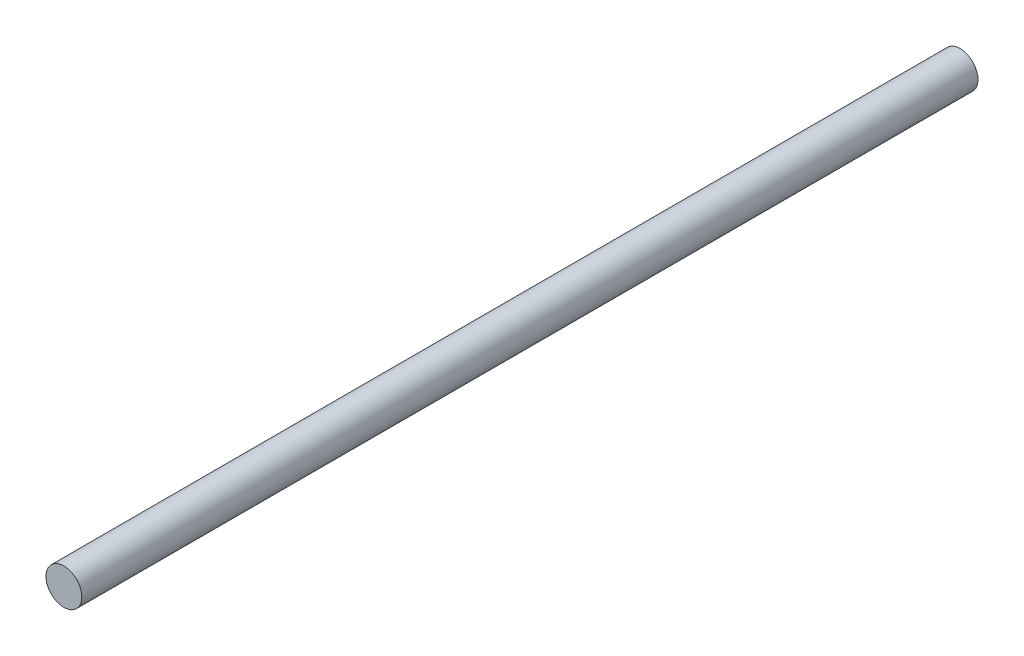
ISO-10303-21;
HEADER;
FILE_DESCRIPTION(('STEP AP214'),'2;1');
FILE_NAME('part.step','',(''),(''),'','','');
FILE_SCHEMA(('AUTOMOTIVE_DESIGN { 1 0 10303 214 1 1 1 1 }'));
ENDSEC;
DATA;
#1=APPLICATION_CONTEXT('core data for automotive mechanical design processes');
#2=APPLICATION_PROTOCOL_DEFINITION('international standard','automotive_design',2000,#1);
#3=PRODUCT_CONTEXT('',#1,'mechanical');
#4=PRODUCT('Part','Part','',(#3));
#5=PRODUCT_RELATED_PRODUCT_CATEGORY('part','',(#4));
#6=PRODUCT_DEFINITION_FORMATION('','',#4);
#7=PRODUCT_DEFINITION_CONTEXT('part definition',#1,'design');
#8=PRODUCT_DEFINITION('design','',#6,#7);
#9=PRODUCT_DEFINITION_SHAPE('','',#8);
#10=(LENGTH_UNIT() NAMED_UNIT(*) SI_UNIT(.MILLI.,.METRE.));
#11=(NAMED_UNIT(*) PLANE_ANGLE_UNIT() SI_UNIT($,.RADIAN.));
#12=(NAMED_UNIT(*) SI_UNIT($,.STERADIAN.) SOLID_ANGLE_UNIT());
#13=UNCERTAINTY_MEASURE_WITH_UNIT(LENGTH_MEASURE(1.E-05),#10,'distance_accuracy_value','');
#14=(GEOMETRIC_REPRESENTATION_CONTEXT(3) GLOBAL_UNCERTAINTY_ASSIGNED_CONTEXT((#13)) GLOBAL_UNIT_ASSIGNED_CONTEXT((#10,
#11,#12)) REPRESENTATION_CONTEXT('',''));
#15=CARTESIAN_POINT('',(0.,0.,0.));
#16=DIRECTION('',(0.,0.,1.));
#17=DIRECTION('',(1.,0.,0.));
#18=AXIS2_PLACEMENT_3D('',#15,#16,#17);
#19=CARTESIAN_POINT('',(2.6,7.00000000000402,-16.2));
#20=DIRECTION('',(0.,0.,1.));
#21=DIRECTION('',(1.,0.,0.));
#22=AXIS2_PLACEMENT_3D('',#19,#20,#21);
#23=PLANE('',#22);
#24=CARTESIAN_POINT('',(2.6,7.00000000000402,-16.2));
#25=DIRECTION('',(0.,0.,1.));
#26=DIRECTION('',(-1.,0.,0.));
#27=AXIS2_PLACEMENT_3D('',#24,#25,#26);
#28=CIRCLE('',#27,0.6);
#29=CARTESIAN_POINT('',(3.2,7.00000000000402,-16.2));
#30=VERTEX_POINT('',#29);
#31=EDGE_CURVE('E11',#30,#30,#28,.T.);
#32=ORIENTED_EDGE('',*,*,#31,.F.);
#33=EDGE_LOOP('',(#32));
#34=FACE_BOUND('',#33,.T.);
#35=ADVANCED_FACE('F16',(#34),#23,.F.);
#36=CARTESIAN_POINT('',(2.6,7.00000000000402,13.8));
#37=DIRECTION('',(0.,0.,1.));
#38=DIRECTION('',(1.,0.,0.));
#39=AXIS2_PLACEMENT_3D('',#36,#37,#38);
#40=PLANE('',#39);
#41=CARTESIAN_POINT('',(2.6,7.00000000000402,13.8));
#42=DIRECTION('',(0.,0.,1.));
#43=DIRECTION('',(-1.,0.,0.));
#44=AXIS2_PLACEMENT_3D('',#41,#42,#43);
#45=CIRCLE('',#44,0.6);
#46=CARTESIAN_POINT('',(3.2,7.00000000000402,13.8));
#47=VERTEX_POINT('',#46);
#48=EDGE_CURVE('E41',#47,#47,#45,.T.);
#49=ORIENTED_EDGE('',*,*,#48,.T.);
#50=EDGE_LOOP('',(#49));
#51=FACE_BOUND('',#50,.T.);
#52=ADVANCED_FACE('F18',(#51),#40,.T.);
#53=CARTESIAN_POINT('',(2.6,7.00000000000402,-16.2));
#54=DIRECTION('',(0.,0.,1.));
#55=DIRECTION('',(-1.,0.,0.));
#56=AXIS2_PLACEMENT_3D('',#53,#54,#55);
#57=CYLINDRICAL_SURFACE('',#56,0.6);
#58=ORIENTED_EDGE('',*,*,#48,.F.);
#59=DIRECTION('',(0.,0.,-1.));
#60=VECTOR('',#59,1.);
#61=CARTESIAN_POINT('',(3.2,7.00000000000402,-16.2));
#62=LINE('',#61,#60);
#63=EDGE_CURVE('E20',#47,#30,#62,.T.);
#64=ORIENTED_EDGE('',*,*,#63,.T.);
#65=ORIENTED_EDGE('',*,*,#31,.T.);
#66=ORIENTED_EDGE('',*,*,#63,.F.);
#67=EDGE_LOOP('',(#58,#64,#65,#66));
#68=FACE_BOUND('',#67,.T.);
#69=ADVANCED_FACE('F40',(#68),#57,.T.);
#70=CLOSED_SHELL('',(#35,#52,#69));
#71=MANIFOLD_SOLID_BREP('B1',#70);
#72=ADVANCED_BREP_SHAPE_REPRESENTATION('',(#18,#71),#14);
#73=SHAPE_DEFINITION_REPRESENTATION(#9,#72);
ENDSEC;
END-ISO-10303-21;
